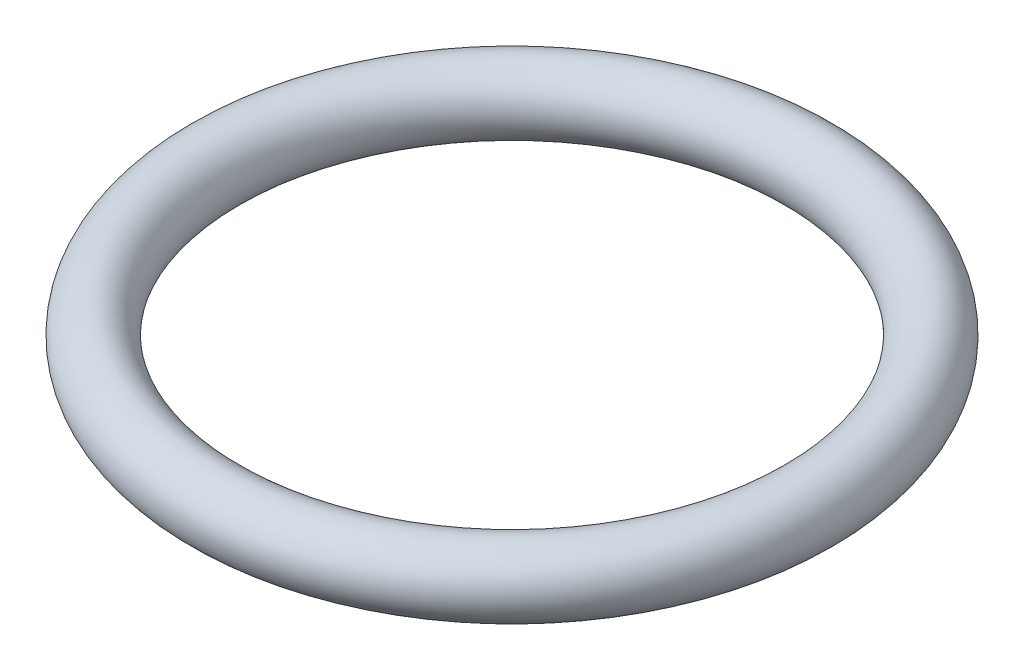
ISO-10303-21;
HEADER;
FILE_DESCRIPTION(('STEP AP214'),'2;1');
FILE_NAME('part.step','',(''),(''),'','','');
FILE_SCHEMA(('AUTOMOTIVE_DESIGN { 1 0 10303 214 1 1 1 1 }'));
ENDSEC;
DATA;
#1=APPLICATION_CONTEXT('core data for automotive mechanical design processes');
#2=APPLICATION_PROTOCOL_DEFINITION('international standard','automotive_design',2000,#1);
#3=PRODUCT_CONTEXT('',#1,'mechanical');
#4=PRODUCT('Part','Part','',(#3));
#5=PRODUCT_RELATED_PRODUCT_CATEGORY('part','',(#4));
#6=PRODUCT_DEFINITION_FORMATION('','',#4);
#7=PRODUCT_DEFINITION_CONTEXT('part definition',#1,'design');
#8=PRODUCT_DEFINITION('design','',#6,#7);
#9=PRODUCT_DEFINITION_SHAPE('','',#8);
#10=(LENGTH_UNIT() NAMED_UNIT(*) SI_UNIT(.MILLI.,.METRE.));
#11=(NAMED_UNIT(*) PLANE_ANGLE_UNIT() SI_UNIT($,.RADIAN.));
#12=(NAMED_UNIT(*) SI_UNIT($,.STERADIAN.) SOLID_ANGLE_UNIT());
#13=UNCERTAINTY_MEASURE_WITH_UNIT(LENGTH_MEASURE(1.E-05),#10,'distance_accuracy_value','');
#14=(GEOMETRIC_REPRESENTATION_CONTEXT(3) GLOBAL_UNCERTAINTY_ASSIGNED_CONTEXT((#13)) GLOBAL_UNIT_ASSIGNED_CONTEXT((#10,
#11,#12)) REPRESENTATION_CONTEXT('',''));
#15=CARTESIAN_POINT('',(0.,0.,0.));
#16=DIRECTION('',(0.,0.,1.));
#17=DIRECTION('',(1.,0.,0.));
#18=AXIS2_PLACEMENT_3D('',#15,#16,#17);
#19=CARTESIAN_POINT('',(0.,0.,0.));
#20=DIRECTION('',(0.,1.,0.));
#21=DIRECTION('',(1.,0.,0.));
#22=AXIS2_PLACEMENT_3D('',#19,#20,#21);
#23=TOROIDAL_SURFACE('',#22,7.89,0.89);
#24=ADVANCED_FACE('F13',(),#23,.T.);
#25=CLOSED_SHELL('',(#24));
#26=MANIFOLD_SOLID_BREP('B1',#25);
#27=ADVANCED_BREP_SHAPE_REPRESENTATION('',(#18,#26),#14);
#28=SHAPE_DEFINITION_REPRESENTATION(#9,#27);
ENDSEC;
END-ISO-10303-21;
